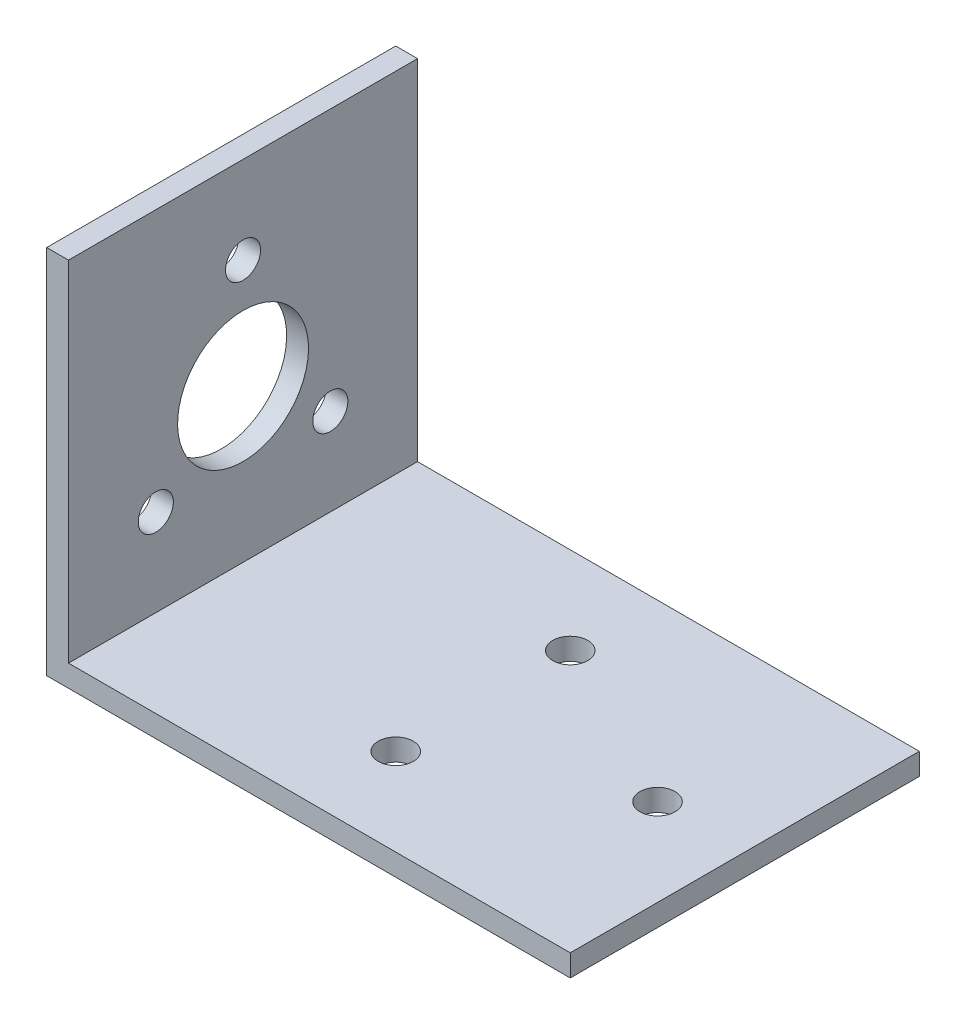
ISO-10303-21;
HEADER;
FILE_DESCRIPTION(('STEP AP214'),'2;1');
FILE_NAME('part.step','',(''),(''),'','','');
FILE_SCHEMA(('AUTOMOTIVE_DESIGN { 1 0 10303 214 1 1 1 1 }'));
ENDSEC;
DATA;
#1=APPLICATION_CONTEXT('core data for automotive mechanical design processes');
#2=APPLICATION_PROTOCOL_DEFINITION('international standard','automotive_design',2000,#1);
#3=PRODUCT_CONTEXT('',#1,'mechanical');
#4=PRODUCT('Part','Part','',(#3));
#5=PRODUCT_RELATED_PRODUCT_CATEGORY('part','',(#4));
#6=PRODUCT_DEFINITION_FORMATION('','',#4);
#7=PRODUCT_DEFINITION_CONTEXT('part definition',#1,'design');
#8=PRODUCT_DEFINITION('design','',#6,#7);
#9=PRODUCT_DEFINITION_SHAPE('','',#8);
#10=(LENGTH_UNIT() NAMED_UNIT(*) SI_UNIT(.MILLI.,.METRE.));
#11=(NAMED_UNIT(*) PLANE_ANGLE_UNIT() SI_UNIT($,.RADIAN.));
#12=(NAMED_UNIT(*) SI_UNIT($,.STERADIAN.) SOLID_ANGLE_UNIT());
#13=UNCERTAINTY_MEASURE_WITH_UNIT(LENGTH_MEASURE(1.E-05),#10,'distance_accuracy_value','');
#14=(GEOMETRIC_REPRESENTATION_CONTEXT(3) GLOBAL_UNCERTAINTY_ASSIGNED_CONTEXT((#13)) GLOBAL_UNIT_ASSIGNED_CONTEXT((#10,
#11,#12)) REPRESENTATION_CONTEXT('',''));
#15=CARTESIAN_POINT('',(0.,0.,0.));
#16=DIRECTION('',(0.,0.,1.));
#17=DIRECTION('',(1.,0.,0.));
#18=AXIS2_PLACEMENT_3D('',#15,#16,#17);
#19=CARTESIAN_POINT('',(73.025,0.,50.8));
#20=DIRECTION('',(-1.,0.,0.));
#21=DIRECTION('',(0.,0.,1.));
#22=AXIS2_PLACEMENT_3D('',#19,#20,#21);
#23=PLANE('',#22);
#24=DIRECTION('',(0.,1.,0.));
#25=VECTOR('',#24,1.);
#26=CARTESIAN_POINT('',(73.025,0.,0.));
#27=LINE('',#26,#25);
#28=CARTESIAN_POINT('',(73.025,0.,0.));
#29=VERTEX_POINT('',#28);
#30=CARTESIAN_POINT('',(73.025,3.175,0.));
#31=VERTEX_POINT('',#30);
#32=EDGE_CURVE('E123',#29,#31,#27,.T.);
#33=ORIENTED_EDGE('',*,*,#32,.T.);
#34=DIRECTION('',(0.,0.,-1.));
#35=VECTOR('',#34,1.);
#36=CARTESIAN_POINT('',(73.025,3.175,50.8));
#37=LINE('',#36,#35);
#38=CARTESIAN_POINT('',(73.025,3.175,50.8));
#39=VERTEX_POINT('',#38);
#40=EDGE_CURVE('E42',#39,#31,#37,.T.);
#41=ORIENTED_EDGE('',*,*,#40,.F.);
#42=DIRECTION('',(0.,1.,0.));
#43=VECTOR('',#42,1.);
#44=CARTESIAN_POINT('',(73.025,0.,50.8));
#45=LINE('',#44,#43);
#46=CARTESIAN_POINT('',(73.025,0.,50.8));
#47=VERTEX_POINT('',#46);
#48=EDGE_CURVE('E89',#47,#39,#45,.T.);
#49=ORIENTED_EDGE('',*,*,#48,.F.);
#50=DIRECTION('',(0.,0.,-1.));
#51=VECTOR('',#50,1.);
#52=CARTESIAN_POINT('',(73.025,0.,50.8));
#53=LINE('',#52,#51);
#54=EDGE_CURVE('E11',#47,#29,#53,.T.);
#55=ORIENTED_EDGE('',*,*,#54,.T.);
#56=EDGE_LOOP('',(#33,#41,#49,#55));
#57=FACE_BOUND('',#56,.T.);
#58=ADVANCED_FACE('F33',(#57),#23,.F.);
#59=CARTESIAN_POINT('',(0.,3.175,50.8));
#60=DIRECTION('',(0.,-1.,0.));
#61=DIRECTION('',(0.,0.,-1.));
#62=AXIS2_PLACEMENT_3D('',#59,#60,#61);
#63=PLANE('',#62);
#64=CARTESIAN_POINT('',(34.925,3.175,38.1));
#65=DIRECTION('',(0.,1.,0.));
#66=DIRECTION('',(0.,0.,1.));
#67=AXIS2_PLACEMENT_3D('',#64,#65,#66);
#68=CIRCLE('',#67,2.5527);
#69=CARTESIAN_POINT('',(34.925,3.175,40.6527));
#70=VERTEX_POINT('',#69);
#71=EDGE_CURVE('E164',#70,#70,#68,.T.);
#72=ORIENTED_EDGE('',*,*,#71,.F.);
#73=EDGE_LOOP('',(#72));
#74=FACE_BOUND('',#73,.T.);
#75=CARTESIAN_POINT('',(34.925,3.175,12.7));
#76=DIRECTION('',(0.,1.,0.));
#77=DIRECTION('',(0.,0.,1.));
#78=AXIS2_PLACEMENT_3D('',#75,#76,#77);
#79=CIRCLE('',#78,2.5527);
#80=CARTESIAN_POINT('',(34.925,3.175,15.2527));
#81=VERTEX_POINT('',#80);
#82=EDGE_CURVE('E154',#81,#81,#79,.T.);
#83=ORIENTED_EDGE('',*,*,#82,.F.);
#84=EDGE_LOOP('',(#83));
#85=FACE_BOUND('',#84,.T.);
#86=CARTESIAN_POINT('',(60.325,3.175,25.4));
#87=DIRECTION('',(0.,1.,0.));
#88=DIRECTION('',(0.,0.,1.));
#89=AXIS2_PLACEMENT_3D('',#86,#87,#88);
#90=CIRCLE('',#89,2.5527);
#91=CARTESIAN_POINT('',(60.325,3.175,27.9527));
#92=VERTEX_POINT('',#91);
#93=EDGE_CURVE('E151',#92,#92,#90,.T.);
#94=ORIENTED_EDGE('',*,*,#93,.F.);
#95=EDGE_LOOP('',(#94));
#96=FACE_BOUND('',#95,.T.);
#97=DIRECTION('',(-1.,0.,0.));
#98=VECTOR('',#97,1.);
#99=CARTESIAN_POINT('',(0.,3.175,0.));
#100=LINE('',#99,#98);
#101=CARTESIAN_POINT('',(0.,3.175,0.));
#102=VERTEX_POINT('',#101);
#103=EDGE_CURVE('E125',#31,#102,#100,.T.);
#104=ORIENTED_EDGE('',*,*,#103,.T.);
#105=DIRECTION('',(0.,0.,-1.));
#106=VECTOR('',#105,1.);
#107=CARTESIAN_POINT('',(0.,3.175,50.8));
#108=LINE('',#107,#106);
#109=CARTESIAN_POINT('',(0.,3.175,50.8));
#110=VERTEX_POINT('',#109);
#111=EDGE_CURVE('E112',#110,#102,#108,.T.);
#112=ORIENTED_EDGE('',*,*,#111,.F.);
#113=DIRECTION('',(-1.,0.,0.));
#114=VECTOR('',#113,1.);
#115=CARTESIAN_POINT('',(0.,3.175,50.8));
#116=LINE('',#115,#114);
#117=EDGE_CURVE('E103',#39,#110,#116,.T.);
#118=ORIENTED_EDGE('',*,*,#117,.F.);
#119=ORIENTED_EDGE('',*,*,#40,.T.);
#120=EDGE_LOOP('',(#104,#112,#118,#119));
#121=FACE_BOUND('',#120,.T.);
#122=ADVANCED_FACE('F178',(#74,#85,#96,#121),#63,.F.);
#123=CARTESIAN_POINT('',(0.,3.175,50.8));
#124=DIRECTION('',(-1.,0.,0.));
#125=DIRECTION('',(0.,-1.,0.));
#126=AXIS2_PLACEMENT_3D('',#123,#124,#125);
#127=PLANE('',#126);
#128=CARTESIAN_POINT('',(0.,25.4,25.4));
#129=DIRECTION('',(1.,0.,0.));
#130=DIRECTION('',(0.,1.,0.));
#131=AXIS2_PLACEMENT_3D('',#128,#129,#130);
#132=CIRCLE('',#131,9.525);
#133=CARTESIAN_POINT('',(0.,34.925,25.4));
#134=VERTEX_POINT('',#133);
#135=EDGE_CURVE('E337',#134,#134,#132,.T.);
#136=ORIENTED_EDGE('',*,*,#135,.F.);
#137=EDGE_LOOP('',(#136));
#138=FACE_BOUND('',#137,.T.);
#139=CARTESIAN_POINT('',(0.,15.875,12.7));
#140=DIRECTION('',(1.,0.,0.));
#141=DIRECTION('',(0.,1.,0.));
#142=AXIS2_PLACEMENT_3D('',#139,#140,#141);
#143=CIRCLE('',#142,2.5527);
#144=CARTESIAN_POINT('',(0.,18.4277,12.7));
#145=VERTEX_POINT('',#144);
#146=EDGE_CURVE('E148',#145,#145,#143,.T.);
#147=ORIENTED_EDGE('',*,*,#146,.F.);
#148=EDGE_LOOP('',(#147));
#149=FACE_BOUND('',#148,.T.);
#150=CARTESIAN_POINT('',(0.,15.875,38.1));
#151=DIRECTION('',(1.,0.,0.));
#152=DIRECTION('',(0.,1.,0.));
#153=AXIS2_PLACEMENT_3D('',#150,#151,#152);
#154=CIRCLE('',#153,2.5527);
#155=CARTESIAN_POINT('',(0.,18.4277,38.1));
#156=VERTEX_POINT('',#155);
#157=EDGE_CURVE('E144',#156,#156,#154,.T.);
#158=ORIENTED_EDGE('',*,*,#157,.F.);
#159=EDGE_LOOP('',(#158));
#160=FACE_BOUND('',#159,.T.);
#161=CARTESIAN_POINT('',(0.,41.275,25.4));
#162=DIRECTION('',(1.,0.,0.));
#163=DIRECTION('',(0.,1.,0.));
#164=AXIS2_PLACEMENT_3D('',#161,#162,#163);
#165=CIRCLE('',#164,2.5527);
#166=CARTESIAN_POINT('',(0.,43.8277,25.4));
#167=VERTEX_POINT('',#166);
#168=EDGE_CURVE('E140',#167,#167,#165,.T.);
#169=ORIENTED_EDGE('',*,*,#168,.F.);
#170=EDGE_LOOP('',(#169));
#171=FACE_BOUND('',#170,.T.);
#172=DIRECTION('',(0.,1.,0.));
#173=VECTOR('',#172,1.);
#174=CARTESIAN_POINT('',(0.,3.175,0.));
#175=LINE('',#174,#173);
#176=CARTESIAN_POINT('',(0.,53.975,0.));
#177=VERTEX_POINT('',#176);
#178=EDGE_CURVE('E111',#102,#177,#175,.T.);
#179=ORIENTED_EDGE('',*,*,#178,.T.);
#180=DIRECTION('',(0.,0.,-1.));
#181=VECTOR('',#180,1.);
#182=CARTESIAN_POINT('',(0.,53.975,50.8));
#183=LINE('',#182,#181);
#184=CARTESIAN_POINT('',(0.,53.975,50.8));
#185=VERTEX_POINT('',#184);
#186=EDGE_CURVE('E108',#185,#177,#183,.T.);
#187=ORIENTED_EDGE('',*,*,#186,.F.);
#188=DIRECTION('',(0.,1.,0.));
#189=VECTOR('',#188,1.);
#190=CARTESIAN_POINT('',(0.,3.175,50.8));
#191=LINE('',#190,#189);
#192=EDGE_CURVE('E97',#110,#185,#191,.T.);
#193=ORIENTED_EDGE('',*,*,#192,.F.);
#194=ORIENTED_EDGE('',*,*,#111,.T.);
#195=EDGE_LOOP('',(#179,#187,#193,#194));
#196=FACE_BOUND('',#195,.T.);
#197=ADVANCED_FACE('F109',(#138,#149,#160,#171,#196),#127,.F.);
#198=CARTESIAN_POINT('',(0.,53.975,50.8));
#199=DIRECTION('',(0.,-1.,0.));
#200=DIRECTION('',(0.,0.,-1.));
#201=AXIS2_PLACEMENT_3D('',#198,#199,#200);
#202=PLANE('',#201);
#203=DIRECTION('',(-1.,0.,0.));
#204=VECTOR('',#203,1.);
#205=CARTESIAN_POINT('',(0.,53.975,0.));
#206=LINE('',#205,#204);
#207=CARTESIAN_POINT('',(-3.175,53.975,0.));
#208=VERTEX_POINT('',#207);
#209=EDGE_CURVE('E75',#177,#208,#206,.T.);
#210=ORIENTED_EDGE('',*,*,#209,.T.);
#211=DIRECTION('',(0.,0.,-1.));
#212=VECTOR('',#211,1.);
#213=CARTESIAN_POINT('',(-3.175,53.975,50.8));
#214=LINE('',#213,#212);
#215=CARTESIAN_POINT('',(-3.175,53.975,50.8));
#216=VERTEX_POINT('',#215);
#217=EDGE_CURVE('E113',#216,#208,#214,.T.);
#218=ORIENTED_EDGE('',*,*,#217,.F.);
#219=DIRECTION('',(-1.,0.,0.));
#220=VECTOR('',#219,1.);
#221=CARTESIAN_POINT('',(0.,53.975,50.8));
#222=LINE('',#221,#220);
#223=EDGE_CURVE('E101',#185,#216,#222,.T.);
#224=ORIENTED_EDGE('',*,*,#223,.F.);
#225=ORIENTED_EDGE('',*,*,#186,.T.);
#226=EDGE_LOOP('',(#210,#218,#224,#225));
#227=FACE_BOUND('',#226,.T.);
#228=ADVANCED_FACE('F115',(#227),#202,.F.);
#229=CARTESIAN_POINT('',(-3.175,0.,50.8));
#230=DIRECTION('',(1.,0.,0.));
#231=DIRECTION('',(0.,0.,-1.));
#232=AXIS2_PLACEMENT_3D('',#229,#230,#231);
#233=PLANE('',#232);
#234=CARTESIAN_POINT('',(-3.175,25.4,25.4));
#235=DIRECTION('',(1.,0.,0.));
#236=DIRECTION('',(0.,1.,0.));
#237=AXIS2_PLACEMENT_3D('',#234,#235,#236);
#238=CIRCLE('',#237,9.525);
#239=CARTESIAN_POINT('',(-3.175,34.925,25.4));
#240=VERTEX_POINT('',#239);
#241=EDGE_CURVE('E334',#240,#240,#238,.T.);
#242=ORIENTED_EDGE('',*,*,#241,.T.);
#243=EDGE_LOOP('',(#242));
#244=FACE_BOUND('',#243,.T.);
#245=CARTESIAN_POINT('',(-3.175,15.875,12.7));
#246=DIRECTION('',(1.,0.,0.));
#247=DIRECTION('',(0.,0.,-1.));
#248=AXIS2_PLACEMENT_3D('',#245,#246,#247);
#249=CIRCLE('',#248,2.5527);
#250=CARTESIAN_POINT('',(-3.175,15.875,10.1473));
#251=VERTEX_POINT('',#250);
#252=EDGE_CURVE('E145',#251,#251,#249,.T.);
#253=ORIENTED_EDGE('',*,*,#252,.T.);
#254=EDGE_LOOP('',(#253));
#255=FACE_BOUND('',#254,.T.);
#256=CARTESIAN_POINT('',(-3.175,15.875,38.1));
#257=DIRECTION('',(1.,0.,0.));
#258=DIRECTION('',(0.,0.,-1.));
#259=AXIS2_PLACEMENT_3D('',#256,#257,#258);
#260=CIRCLE('',#259,2.5527);
#261=CARTESIAN_POINT('',(-3.175,15.875,35.5473));
#262=VERTEX_POINT('',#261);
#263=EDGE_CURVE('E141',#262,#262,#260,.T.);
#264=ORIENTED_EDGE('',*,*,#263,.T.);
#265=EDGE_LOOP('',(#264));
#266=FACE_BOUND('',#265,.T.);
#267=CARTESIAN_POINT('',(-3.175,41.275,25.4));
#268=DIRECTION('',(1.,0.,0.));
#269=DIRECTION('',(0.,0.,-1.));
#270=AXIS2_PLACEMENT_3D('',#267,#268,#269);
#271=CIRCLE('',#270,2.5527);
#272=CARTESIAN_POINT('',(-3.175,41.275,22.8473));
#273=VERTEX_POINT('',#272);
#274=EDGE_CURVE('E126',#273,#273,#271,.T.);
#275=ORIENTED_EDGE('',*,*,#274,.T.);
#276=EDGE_LOOP('',(#275));
#277=FACE_BOUND('',#276,.T.);
#278=DIRECTION('',(0.,-1.,0.));
#279=VECTOR('',#278,1.);
#280=CARTESIAN_POINT('',(-3.175,0.,0.));
#281=LINE('',#280,#279);
#282=CARTESIAN_POINT('',(-3.175,0.,0.));
#283=VERTEX_POINT('',#282);
#284=EDGE_CURVE('E82',#208,#283,#281,.T.);
#285=ORIENTED_EDGE('',*,*,#284,.T.);
#286=DIRECTION('',(0.,0.,-1.));
#287=VECTOR('',#286,1.);
#288=CARTESIAN_POINT('',(-3.175,0.,50.8));
#289=LINE('',#288,#287);
#290=CARTESIAN_POINT('',(-3.175,0.,50.8));
#291=VERTEX_POINT('',#290);
#292=EDGE_CURVE('E119',#291,#283,#289,.T.);
#293=ORIENTED_EDGE('',*,*,#292,.F.);
#294=DIRECTION('',(0.,-1.,0.));
#295=VECTOR('',#294,1.);
#296=CARTESIAN_POINT('',(-3.175,0.,50.8));
#297=LINE('',#296,#295);
#298=EDGE_CURVE('E117',#216,#291,#297,.T.);
#299=ORIENTED_EDGE('',*,*,#298,.F.);
#300=ORIENTED_EDGE('',*,*,#217,.T.);
#301=EDGE_LOOP('',(#285,#293,#299,#300));
#302=FACE_BOUND('',#301,.T.);
#303=ADVANCED_FACE('F183',(#244,#255,#266,#277,#302),#233,.F.);
#304=CARTESIAN_POINT('',(0.,0.,50.8));
#305=DIRECTION('',(0.,1.,0.));
#306=DIRECTION('',(0.,0.,1.));
#307=AXIS2_PLACEMENT_3D('',#304,#305,#306);
#308=PLANE('',#307);
#309=CARTESIAN_POINT('',(34.925,0.,38.1));
#310=DIRECTION('',(0.,1.,0.));
#311=DIRECTION('',(0.,0.,1.));
#312=AXIS2_PLACEMENT_3D('',#309,#310,#311);
#313=CIRCLE('',#312,2.5527);
#314=CARTESIAN_POINT('',(34.925,0.,40.6527));
#315=VERTEX_POINT('',#314);
#316=EDGE_CURVE('E36',#315,#315,#313,.T.);
#317=ORIENTED_EDGE('',*,*,#316,.T.);
#318=EDGE_LOOP('',(#317));
#319=FACE_BOUND('',#318,.T.);
#320=CARTESIAN_POINT('',(34.925,0.,12.7));
#321=DIRECTION('',(0.,1.,0.));
#322=DIRECTION('',(0.,0.,1.));
#323=AXIS2_PLACEMENT_3D('',#320,#321,#322);
#324=CIRCLE('',#323,2.5527);
#325=CARTESIAN_POINT('',(34.925,0.,15.2527));
#326=VERTEX_POINT('',#325);
#327=EDGE_CURVE('E152',#326,#326,#324,.T.);
#328=ORIENTED_EDGE('',*,*,#327,.T.);
#329=EDGE_LOOP('',(#328));
#330=FACE_BOUND('',#329,.T.);
#331=CARTESIAN_POINT('',(60.325,0.,25.4));
#332=DIRECTION('',(0.,1.,0.));
#333=DIRECTION('',(0.,0.,1.));
#334=AXIS2_PLACEMENT_3D('',#331,#332,#333);
#335=CIRCLE('',#334,2.5527);
#336=CARTESIAN_POINT('',(60.325,0.,27.9527));
#337=VERTEX_POINT('',#336);
#338=EDGE_CURVE('E149',#337,#337,#335,.T.);
#339=ORIENTED_EDGE('',*,*,#338,.T.);
#340=EDGE_LOOP('',(#339));
#341=FACE_BOUND('',#340,.T.);
#342=DIRECTION('',(1.,0.,0.));
#343=VECTOR('',#342,1.);
#344=CARTESIAN_POINT('',(0.,0.,0.));
#345=LINE('',#344,#343);
#346=EDGE_CURVE('E131',#283,#29,#345,.T.);
#347=ORIENTED_EDGE('',*,*,#346,.T.);
#348=ORIENTED_EDGE('',*,*,#54,.F.);
#349=DIRECTION('',(1.,0.,0.));
#350=VECTOR('',#349,1.);
#351=CARTESIAN_POINT('',(0.,0.,50.8));
#352=LINE('',#351,#350);
#353=EDGE_CURVE('E51',#291,#47,#352,.T.);
#354=ORIENTED_EDGE('',*,*,#353,.F.);
#355=ORIENTED_EDGE('',*,*,#292,.T.);
#356=EDGE_LOOP('',(#347,#348,#354,#355));
#357=FACE_BOUND('',#356,.T.);
#358=ADVANCED_FACE('F182',(#319,#330,#341,#357),#308,.F.);
#359=CARTESIAN_POINT('',(0.,0.,50.8));
#360=DIRECTION('',(0.,0.,1.));
#361=DIRECTION('',(1.,0.,0.));
#362=AXIS2_PLACEMENT_3D('',#359,#360,#361);
#363=PLANE('',#362);
#364=ORIENTED_EDGE('',*,*,#353,.T.);
#365=ORIENTED_EDGE('',*,*,#48,.T.);
#366=ORIENTED_EDGE('',*,*,#117,.T.);
#367=ORIENTED_EDGE('',*,*,#192,.T.);
#368=ORIENTED_EDGE('',*,*,#223,.T.);
#369=ORIENTED_EDGE('',*,*,#298,.T.);
#370=EDGE_LOOP('',(#364,#365,#366,#367,#368,#369));
#371=FACE_BOUND('',#370,.T.);
#372=ADVANCED_FACE('F99',(#371),#363,.T.);
#373=CARTESIAN_POINT('',(0.,0.,0.));
#374=DIRECTION('',(0.,0.,1.));
#375=DIRECTION('',(1.,0.,0.));
#376=AXIS2_PLACEMENT_3D('',#373,#374,#375);
#377=PLANE('',#376);
#378=ORIENTED_EDGE('',*,*,#32,.F.);
#379=ORIENTED_EDGE('',*,*,#346,.F.);
#380=ORIENTED_EDGE('',*,*,#284,.F.);
#381=ORIENTED_EDGE('',*,*,#209,.F.);
#382=ORIENTED_EDGE('',*,*,#178,.F.);
#383=ORIENTED_EDGE('',*,*,#103,.F.);
#384=EDGE_LOOP('',(#378,#379,#380,#381,#382,#383));
#385=FACE_BOUND('',#384,.T.);
#386=ADVANCED_FACE('F180',(#385),#377,.F.);
#387=CARTESIAN_POINT('',(-50.8,41.275,25.4));
#388=DIRECTION('',(1.,0.,0.));
#389=DIRECTION('',(0.,1.,0.));
#390=AXIS2_PLACEMENT_3D('',#387,#388,#389);
#391=CYLINDRICAL_SURFACE('',#390,2.5527);
#392=ORIENTED_EDGE('',*,*,#168,.T.);
#393=EDGE_LOOP('',(#392));
#394=FACE_BOUND('',#393,.T.);
#395=ORIENTED_EDGE('',*,*,#274,.F.);
#396=EDGE_LOOP('',(#395));
#397=FACE_BOUND('',#396,.T.);
#398=ADVANCED_FACE('F235',(#394,#397),#391,.F.);
#399=CARTESIAN_POINT('',(-50.8,15.875,38.1));
#400=DIRECTION('',(1.,0.,0.));
#401=DIRECTION('',(0.,1.,0.));
#402=AXIS2_PLACEMENT_3D('',#399,#400,#401);
#403=CYLINDRICAL_SURFACE('',#402,2.5527);
#404=ORIENTED_EDGE('',*,*,#157,.T.);
#405=EDGE_LOOP('',(#404));
#406=FACE_BOUND('',#405,.T.);
#407=ORIENTED_EDGE('',*,*,#263,.F.);
#408=EDGE_LOOP('',(#407));
#409=FACE_BOUND('',#408,.T.);
#410=ADVANCED_FACE('F228',(#406,#409),#403,.F.);
#411=CARTESIAN_POINT('',(-50.8,15.875,12.7));
#412=DIRECTION('',(1.,0.,0.));
#413=DIRECTION('',(0.,1.,0.));
#414=AXIS2_PLACEMENT_3D('',#411,#412,#413);
#415=CYLINDRICAL_SURFACE('',#414,2.5527);
#416=ORIENTED_EDGE('',*,*,#146,.T.);
#417=EDGE_LOOP('',(#416));
#418=FACE_BOUND('',#417,.T.);
#419=ORIENTED_EDGE('',*,*,#252,.F.);
#420=EDGE_LOOP('',(#419));
#421=FACE_BOUND('',#420,.T.);
#422=ADVANCED_FACE('F218',(#418,#421),#415,.F.);
#423=CARTESIAN_POINT('',(60.325,-47.625,25.4));
#424=DIRECTION('',(0.,1.,0.));
#425=DIRECTION('',(0.,0.,1.));
#426=AXIS2_PLACEMENT_3D('',#423,#424,#425);
#427=CYLINDRICAL_SURFACE('',#426,2.5527);
#428=ORIENTED_EDGE('',*,*,#93,.T.);
#429=EDGE_LOOP('',(#428));
#430=FACE_BOUND('',#429,.T.);
#431=ORIENTED_EDGE('',*,*,#338,.F.);
#432=EDGE_LOOP('',(#431));
#433=FACE_BOUND('',#432,.T.);
#434=ADVANCED_FACE('F214',(#430,#433),#427,.F.);
#435=CARTESIAN_POINT('',(34.925,-47.625,12.7));
#436=DIRECTION('',(0.,1.,0.));
#437=DIRECTION('',(0.,0.,1.));
#438=AXIS2_PLACEMENT_3D('',#435,#436,#437);
#439=CYLINDRICAL_SURFACE('',#438,2.5527);
#440=ORIENTED_EDGE('',*,*,#82,.T.);
#441=EDGE_LOOP('',(#440));
#442=FACE_BOUND('',#441,.T.);
#443=ORIENTED_EDGE('',*,*,#327,.F.);
#444=EDGE_LOOP('',(#443));
#445=FACE_BOUND('',#444,.T.);
#446=ADVANCED_FACE('F217',(#442,#445),#439,.F.);
#447=CARTESIAN_POINT('',(34.925,-47.625,38.1));
#448=DIRECTION('',(0.,1.,0.));
#449=DIRECTION('',(0.,0.,1.));
#450=AXIS2_PLACEMENT_3D('',#447,#448,#449);
#451=CYLINDRICAL_SURFACE('',#450,2.5527);
#452=ORIENTED_EDGE('',*,*,#71,.T.);
#453=EDGE_LOOP('',(#452));
#454=FACE_BOUND('',#453,.T.);
#455=ORIENTED_EDGE('',*,*,#316,.F.);
#456=EDGE_LOOP('',(#455));
#457=FACE_BOUND('',#456,.T.);
#458=ADVANCED_FACE('F226',(#454,#457),#451,.F.);
#459=CARTESIAN_POINT('',(-3.175,25.4,25.4));
#460=DIRECTION('',(1.,0.,0.));
#461=DIRECTION('',(0.,1.,0.));
#462=AXIS2_PLACEMENT_3D('',#459,#460,#461);
#463=CYLINDRICAL_SURFACE('',#462,9.525);
#464=ORIENTED_EDGE('',*,*,#241,.F.);
#465=EDGE_LOOP('',(#464));
#466=FACE_BOUND('',#465,.T.);
#467=ORIENTED_EDGE('',*,*,#135,.T.);
#468=EDGE_LOOP('',(#467));
#469=FACE_BOUND('',#468,.T.);
#470=ADVANCED_FACE('F291',(#466,#469),#463,.F.);
#471=CLOSED_SHELL('',(#58,#122,#197,#228,#303,#358,#372,#386,#398,#410,#422,#434,#446,#458,#470));
#472=MANIFOLD_SOLID_BREP('B2',#471);
#473=ADVANCED_BREP_SHAPE_REPRESENTATION('',(#18,#472),#14);
#474=SHAPE_DEFINITION_REPRESENTATION(#9,#473);
ENDSEC;
END-ISO-10303-21;
